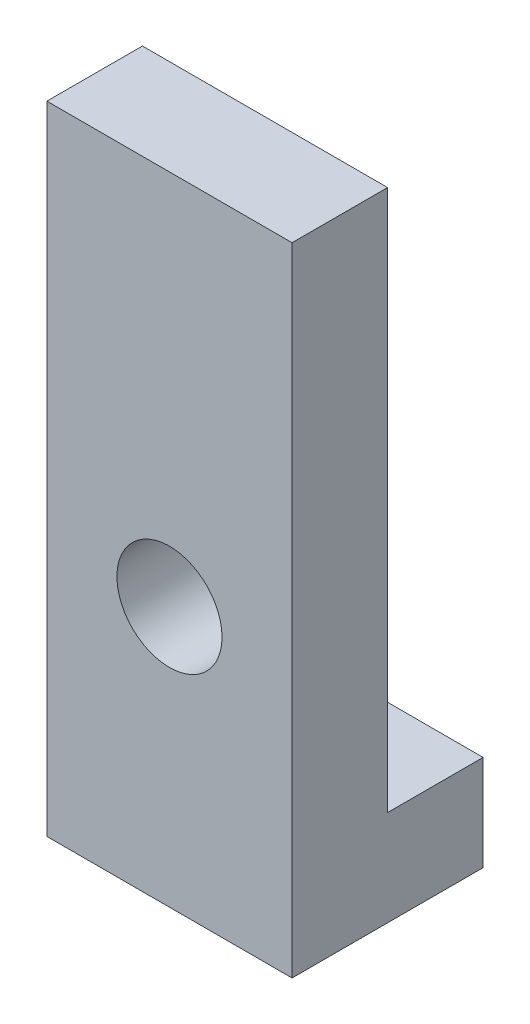
ISO-10303-21;
HEADER;
FILE_DESCRIPTION(('STEP AP214'),'2;1');
FILE_NAME('part.step','',(''),(''),'','','');
FILE_SCHEMA(('AUTOMOTIVE_DESIGN { 1 0 10303 214 1 1 1 1 }'));
ENDSEC;
DATA;
#1=APPLICATION_CONTEXT('core data for automotive mechanical design processes');
#2=APPLICATION_PROTOCOL_DEFINITION('international standard','automotive_design',2000,#1);
#3=PRODUCT_CONTEXT('',#1,'mechanical');
#4=PRODUCT('Part','Part','',(#3));
#5=PRODUCT_RELATED_PRODUCT_CATEGORY('part','',(#4));
#6=PRODUCT_DEFINITION_FORMATION('','',#4);
#7=PRODUCT_DEFINITION_CONTEXT('part definition',#1,'design');
#8=PRODUCT_DEFINITION('design','',#6,#7);
#9=PRODUCT_DEFINITION_SHAPE('','',#8);
#10=(LENGTH_UNIT() NAMED_UNIT(*) SI_UNIT(.MILLI.,.METRE.));
#11=(NAMED_UNIT(*) PLANE_ANGLE_UNIT() SI_UNIT($,.RADIAN.));
#12=(NAMED_UNIT(*) SI_UNIT($,.STERADIAN.) SOLID_ANGLE_UNIT());
#13=UNCERTAINTY_MEASURE_WITH_UNIT(LENGTH_MEASURE(1.E-05),#10,'distance_accuracy_value','');
#14=(GEOMETRIC_REPRESENTATION_CONTEXT(3) GLOBAL_UNCERTAINTY_ASSIGNED_CONTEXT((#13)) GLOBAL_UNIT_ASSIGNED_CONTEXT((#10,
#11,#12)) REPRESENTATION_CONTEXT('',''));
#15=CARTESIAN_POINT('',(0.,0.,0.));
#16=DIRECTION('',(0.,0.,1.));
#17=DIRECTION('',(1.,0.,0.));
#18=AXIS2_PLACEMENT_3D('',#15,#16,#17);
#19=CARTESIAN_POINT('',(0.,0.,3.));
#20=DIRECTION('',(0.,0.,1.));
#21=DIRECTION('',(1.,0.,0.));
#22=AXIS2_PLACEMENT_3D('',#19,#20,#21);
#23=PLANE('',#22);
#24=DIRECTION('',(0.,1.,0.));
#25=VECTOR('',#24,1.);
#26=CARTESIAN_POINT('',(-1.79999999999999,-20.,3.));
#27=LINE('',#26,#25);
#28=CARTESIAN_POINT('',(-1.79999999999999,-23.,3.));
#29=VERTEX_POINT('',#28);
#30=CARTESIAN_POINT('',(-1.79999999999999,-3.,3.));
#31=VERTEX_POINT('',#30);
#32=EDGE_CURVE('E89',#29,#31,#27,.T.);
#33=ORIENTED_EDGE('',*,*,#32,.T.);
#34=DIRECTION('',(-1.,0.,0.));
#35=VECTOR('',#34,1.);
#36=CARTESIAN_POINT('',(-1.79999999999999,-3.,3.));
#37=LINE('',#36,#35);
#38=CARTESIAN_POINT('',(-9.50000000000001,-3.,3.));
#39=VERTEX_POINT('',#38);
#40=EDGE_CURVE('E52',#31,#39,#37,.T.);
#41=ORIENTED_EDGE('',*,*,#40,.T.);
#42=DIRECTION('',(0.,-1.,0.));
#43=VECTOR('',#42,1.);
#44=CARTESIAN_POINT('',(-9.50000000000001,-20.,3.));
#45=LINE('',#44,#43);
#46=CARTESIAN_POINT('',(-9.50000000000001,-23.,3.));
#47=VERTEX_POINT('',#46);
#48=EDGE_CURVE('E123',#39,#47,#45,.T.);
#49=ORIENTED_EDGE('',*,*,#48,.T.);
#50=DIRECTION('',(-1.,0.,0.));
#51=VECTOR('',#50,1.);
#52=CARTESIAN_POINT('',(-1.79999999999999,-23.,3.));
#53=LINE('',#52,#51);
#54=EDGE_CURVE('E152',#29,#47,#53,.T.);
#55=ORIENTED_EDGE('',*,*,#54,.F.);
#56=EDGE_LOOP('',(#33,#41,#49,#55));
#57=FACE_BOUND('',#56,.T.);
#58=CARTESIAN_POINT('',(-5.65,-14.8295040212929,3.));
#59=DIRECTION('',(0.,0.,1.));
#60=DIRECTION('',(1.,0.,0.));
#61=AXIS2_PLACEMENT_3D('',#58,#59,#60);
#62=CIRCLE('',#61,1.65);
#63=CARTESIAN_POINT('',(-4.,-14.8295040212929,3.));
#64=VERTEX_POINT('',#63);
#65=EDGE_CURVE('E104',#64,#64,#62,.T.);
#66=ORIENTED_EDGE('',*,*,#65,.F.);
#67=EDGE_LOOP('',(#66));
#68=FACE_BOUND('',#67,.T.);
#69=ADVANCED_FACE('F33',(#57,#68),#23,.T.);
#70=CARTESIAN_POINT('',(0.,0.,0.));
#71=DIRECTION('',(0.,0.,1.));
#72=DIRECTION('',(1.,0.,0.));
#73=AXIS2_PLACEMENT_3D('',#70,#71,#72);
#74=PLANE('',#73);
#75=DIRECTION('',(0.,1.,0.));
#76=VECTOR('',#75,1.);
#77=CARTESIAN_POINT('',(-1.79999999999999,-20.,0.));
#78=LINE('',#77,#76);
#79=CARTESIAN_POINT('',(-1.79999999999999,-20.,0.));
#80=VERTEX_POINT('',#79);
#81=CARTESIAN_POINT('',(-1.79999999999999,-3.,0.));
#82=VERTEX_POINT('',#81);
#83=EDGE_CURVE('E85',#80,#82,#78,.T.);
#84=ORIENTED_EDGE('',*,*,#83,.F.);
#85=DIRECTION('',(1.,0.,0.));
#86=VECTOR('',#85,1.);
#87=CARTESIAN_POINT('',(-1.79999999999999,-20.,0.));
#88=LINE('',#87,#86);
#89=CARTESIAN_POINT('',(-9.50000000000001,-20.,0.));
#90=VERTEX_POINT('',#89);
#91=EDGE_CURVE('E79',#90,#80,#88,.T.);
#92=ORIENTED_EDGE('',*,*,#91,.F.);
#93=DIRECTION('',(0.,-1.,0.));
#94=VECTOR('',#93,1.);
#95=CARTESIAN_POINT('',(-9.50000000000001,-20.,0.));
#96=LINE('',#95,#94);
#97=CARTESIAN_POINT('',(-9.50000000000001,-3.,0.));
#98=VERTEX_POINT('',#97);
#99=EDGE_CURVE('E69',#98,#90,#96,.T.);
#100=ORIENTED_EDGE('',*,*,#99,.F.);
#101=DIRECTION('',(-1.,0.,0.));
#102=VECTOR('',#101,1.);
#103=CARTESIAN_POINT('',(-1.79999999999999,-3.,0.));
#104=LINE('',#103,#102);
#105=EDGE_CURVE('E63',#82,#98,#104,.T.);
#106=ORIENTED_EDGE('',*,*,#105,.F.);
#107=EDGE_LOOP('',(#84,#92,#100,#106));
#108=FACE_BOUND('',#107,.T.);
#109=CARTESIAN_POINT('',(-5.65,-14.8295040212929,0.));
#110=DIRECTION('',(0.,0.,1.));
#111=DIRECTION('',(1.,0.,0.));
#112=AXIS2_PLACEMENT_3D('',#109,#110,#111);
#113=CIRCLE('',#112,1.65);
#114=CARTESIAN_POINT('',(-4.,-14.8295040212929,0.));
#115=VERTEX_POINT('',#114);
#116=EDGE_CURVE('E114',#115,#115,#113,.T.);
#117=ORIENTED_EDGE('',*,*,#116,.T.);
#118=EDGE_LOOP('',(#117));
#119=FACE_BOUND('',#118,.T.);
#120=ADVANCED_FACE('F82',(#108,#119),#74,.F.);
#121=CARTESIAN_POINT('',(-1.79999999999999,-20.,3.));
#122=DIRECTION('',(-1.,0.,0.));
#123=DIRECTION('',(0.,0.,1.));
#124=AXIS2_PLACEMENT_3D('',#121,#122,#123);
#125=PLANE('',#124);
#126=ORIENTED_EDGE('',*,*,#83,.T.);
#127=DIRECTION('',(0.,0.,-1.));
#128=VECTOR('',#127,1.);
#129=CARTESIAN_POINT('',(-1.79999999999999,-3.,3.));
#130=LINE('',#129,#128);
#131=EDGE_CURVE('E11',#31,#82,#130,.T.);
#132=ORIENTED_EDGE('',*,*,#131,.F.);
#133=ORIENTED_EDGE('',*,*,#32,.F.);
#134=DIRECTION('',(0.,0.,1.));
#135=VECTOR('',#134,1.);
#136=CARTESIAN_POINT('',(-1.79999999999999,-23.,3.));
#137=LINE('',#136,#135);
#138=CARTESIAN_POINT('',(-1.79999999999999,-23.,-3.));
#139=VERTEX_POINT('',#138);
#140=EDGE_CURVE('E97',#139,#29,#137,.T.);
#141=ORIENTED_EDGE('',*,*,#140,.F.);
#142=DIRECTION('',(0.,1.,0.));
#143=VECTOR('',#142,1.);
#144=CARTESIAN_POINT('',(-1.79999999999999,-23.,-3.));
#145=LINE('',#144,#143);
#146=CARTESIAN_POINT('',(-1.79999999999999,-20.,-3.));
#147=VERTEX_POINT('',#146);
#148=EDGE_CURVE('E110',#139,#147,#145,.T.);
#149=ORIENTED_EDGE('',*,*,#148,.T.);
#150=DIRECTION('',(0.,0.,1.));
#151=VECTOR('',#150,1.);
#152=CARTESIAN_POINT('',(-1.79999999999999,-20.,3.));
#153=LINE('',#152,#151);
#154=EDGE_CURVE('E95',#147,#80,#153,.T.);
#155=ORIENTED_EDGE('',*,*,#154,.T.);
#156=EDGE_LOOP('',(#126,#132,#133,#141,#149,#155));
#157=FACE_BOUND('',#156,.T.);
#158=ADVANCED_FACE('F35',(#157),#125,.F.);
#159=CARTESIAN_POINT('',(-1.79999999999999,-3.,3.));
#160=DIRECTION('',(0.,-1.,0.));
#161=DIRECTION('',(0.,0.,-1.));
#162=AXIS2_PLACEMENT_3D('',#159,#160,#161);
#163=PLANE('',#162);
#164=ORIENTED_EDGE('',*,*,#105,.T.);
#165=DIRECTION('',(0.,0.,-1.));
#166=VECTOR('',#165,1.);
#167=CARTESIAN_POINT('',(-9.50000000000001,-3.,3.));
#168=LINE('',#167,#166);
#169=EDGE_CURVE('E43',#39,#98,#168,.T.);
#170=ORIENTED_EDGE('',*,*,#169,.F.);
#171=ORIENTED_EDGE('',*,*,#40,.F.);
#172=ORIENTED_EDGE('',*,*,#131,.T.);
#173=EDGE_LOOP('',(#164,#170,#171,#172));
#174=FACE_BOUND('',#173,.T.);
#175=ADVANCED_FACE('F181',(#174),#163,.F.);
#176=CARTESIAN_POINT('',(-9.50000000000001,-20.,3.));
#177=DIRECTION('',(1.,0.,0.));
#178=DIRECTION('',(0.,0.,-1.));
#179=AXIS2_PLACEMENT_3D('',#176,#177,#178);
#180=PLANE('',#179);
#181=ORIENTED_EDGE('',*,*,#99,.T.);
#182=DIRECTION('',(0.,0.,-1.));
#183=VECTOR('',#182,1.);
#184=CARTESIAN_POINT('',(-9.50000000000001,-20.,3.));
#185=LINE('',#184,#183);
#186=CARTESIAN_POINT('',(-9.50000000000001,-20.,-3.));
#187=VERTEX_POINT('',#186);
#188=EDGE_CURVE('E75',#90,#187,#185,.T.);
#189=ORIENTED_EDGE('',*,*,#188,.T.);
#190=DIRECTION('',(0.,1.,0.));
#191=VECTOR('',#190,1.);
#192=CARTESIAN_POINT('',(-9.50000000000001,-23.,-3.));
#193=LINE('',#192,#191);
#194=CARTESIAN_POINT('',(-9.50000000000001,-23.,-3.));
#195=VERTEX_POINT('',#194);
#196=EDGE_CURVE('E112',#195,#187,#193,.T.);
#197=ORIENTED_EDGE('',*,*,#196,.F.);
#198=DIRECTION('',(0.,0.,-1.));
#199=VECTOR('',#198,1.);
#200=CARTESIAN_POINT('',(-9.50000000000001,-23.,3.));
#201=LINE('',#200,#199);
#202=EDGE_CURVE('E157',#47,#195,#201,.T.);
#203=ORIENTED_EDGE('',*,*,#202,.F.);
#204=ORIENTED_EDGE('',*,*,#48,.F.);
#205=ORIENTED_EDGE('',*,*,#169,.T.);
#206=EDGE_LOOP('',(#181,#189,#197,#203,#204,#205));
#207=FACE_BOUND('',#206,.T.);
#208=ADVANCED_FACE('F71',(#207),#180,.F.);
#209=CARTESIAN_POINT('',(-5.65,-14.8295040212929,3.));
#210=DIRECTION('',(0.,0.,-1.));
#211=DIRECTION('',(-1.,0.,0.));
#212=AXIS2_PLACEMENT_3D('',#209,#210,#211);
#213=CYLINDRICAL_SURFACE('',#212,1.65);
#214=ORIENTED_EDGE('',*,*,#65,.T.);
#215=EDGE_LOOP('',(#214));
#216=FACE_BOUND('',#215,.T.);
#217=ORIENTED_EDGE('',*,*,#116,.F.);
#218=EDGE_LOOP('',(#217));
#219=FACE_BOUND('',#218,.T.);
#220=ADVANCED_FACE('F163',(#216,#219),#213,.F.);
#221=CARTESIAN_POINT('',(-1.79999999999999,-23.,-3.));
#222=DIRECTION('',(0.,0.,1.));
#223=DIRECTION('',(1.,0.,0.));
#224=AXIS2_PLACEMENT_3D('',#221,#222,#223);
#225=PLANE('',#224);
#226=DIRECTION('',(1.,0.,0.));
#227=VECTOR('',#226,1.);
#228=CARTESIAN_POINT('',(-1.79999999999999,-20.,-3.));
#229=LINE('',#228,#227);
#230=EDGE_CURVE('E94',#187,#147,#229,.T.);
#231=ORIENTED_EDGE('',*,*,#230,.T.);
#232=ORIENTED_EDGE('',*,*,#148,.F.);
#233=DIRECTION('',(1.,0.,0.));
#234=VECTOR('',#233,1.);
#235=CARTESIAN_POINT('',(-1.79999999999999,-23.,-3.));
#236=LINE('',#235,#234);
#237=EDGE_CURVE('E113',#195,#139,#236,.T.);
#238=ORIENTED_EDGE('',*,*,#237,.F.);
#239=ORIENTED_EDGE('',*,*,#196,.T.);
#240=EDGE_LOOP('',(#231,#232,#238,#239));
#241=FACE_BOUND('',#240,.T.);
#242=ADVANCED_FACE('F161',(#241),#225,.F.);
#243=CARTESIAN_POINT('',(0.,-23.,0.));
#244=DIRECTION('',(0.,1.,0.));
#245=DIRECTION('',(0.,0.,1.));
#246=AXIS2_PLACEMENT_3D('',#243,#244,#245);
#247=PLANE('',#246);
#248=ORIENTED_EDGE('',*,*,#140,.T.);
#249=ORIENTED_EDGE('',*,*,#54,.T.);
#250=ORIENTED_EDGE('',*,*,#202,.T.);
#251=ORIENTED_EDGE('',*,*,#237,.T.);
#252=EDGE_LOOP('',(#248,#249,#250,#251));
#253=FACE_BOUND('',#252,.T.);
#254=ADVANCED_FACE('F156',(#253),#247,.F.);
#255=CARTESIAN_POINT('',(0.,-20.,0.));
#256=DIRECTION('',(0.,1.,0.));
#257=DIRECTION('',(0.,0.,1.));
#258=AXIS2_PLACEMENT_3D('',#255,#256,#257);
#259=PLANE('',#258);
#260=ORIENTED_EDGE('',*,*,#188,.F.);
#261=ORIENTED_EDGE('',*,*,#91,.T.);
#262=ORIENTED_EDGE('',*,*,#154,.F.);
#263=ORIENTED_EDGE('',*,*,#230,.F.);
#264=EDGE_LOOP('',(#260,#261,#262,#263));
#265=FACE_BOUND('',#264,.T.);
#266=ADVANCED_FACE('F92',(#265),#259,.T.);
#267=CLOSED_SHELL('',(#69,#120,#158,#175,#208,#220,#242,#254,#266));
#268=MANIFOLD_SOLID_BREP('B2',#267);
#269=ADVANCED_BREP_SHAPE_REPRESENTATION('',(#18,#268),#14);
#270=SHAPE_DEFINITION_REPRESENTATION(#9,#269);
ENDSEC;
END-ISO-10303-21;
